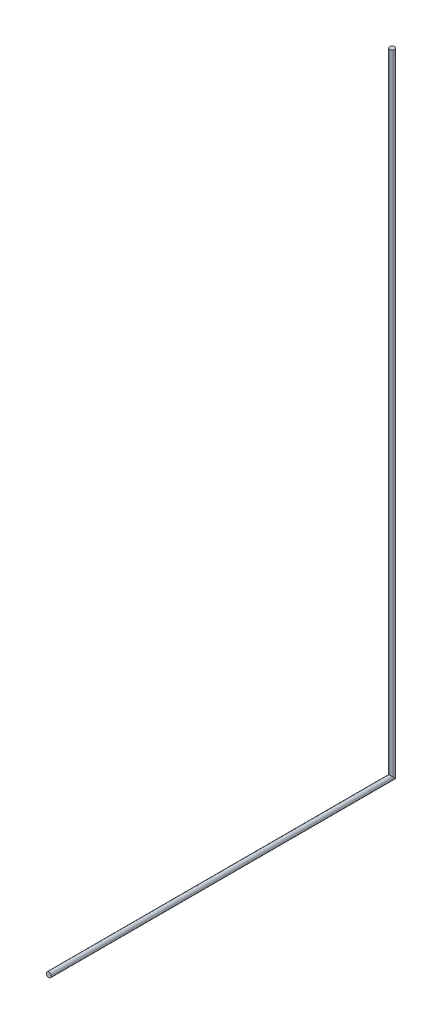
ISO-10303-21;
HEADER;
FILE_DESCRIPTION(('STEP AP214'),'2;1');
FILE_NAME('part.step','',(''),(''),'','','');
FILE_SCHEMA(('AUTOMOTIVE_DESIGN { 1 0 10303 214 1 1 1 1 }'));
ENDSEC;
DATA;
#1=APPLICATION_CONTEXT('core data for automotive mechanical design processes');
#2=APPLICATION_PROTOCOL_DEFINITION('international standard','automotive_design',2000,#1);
#3=PRODUCT_CONTEXT('',#1,'mechanical');
#4=PRODUCT('Part','Part','',(#3));
#5=PRODUCT_RELATED_PRODUCT_CATEGORY('part','',(#4));
#6=PRODUCT_DEFINITION_FORMATION('','',#4);
#7=PRODUCT_DEFINITION_CONTEXT('part definition',#1,'design');
#8=PRODUCT_DEFINITION('design','',#6,#7);
#9=PRODUCT_DEFINITION_SHAPE('','',#8);
#10=(LENGTH_UNIT() NAMED_UNIT(*) SI_UNIT(.MILLI.,.METRE.));
#11=(NAMED_UNIT(*) PLANE_ANGLE_UNIT() SI_UNIT($,.RADIAN.));
#12=(NAMED_UNIT(*) SI_UNIT($,.STERADIAN.) SOLID_ANGLE_UNIT());
#13=UNCERTAINTY_MEASURE_WITH_UNIT(LENGTH_MEASURE(1.E-05),#10,'distance_accuracy_value','');
#14=(GEOMETRIC_REPRESENTATION_CONTEXT(3) GLOBAL_UNCERTAINTY_ASSIGNED_CONTEXT((#13)) GLOBAL_UNIT_ASSIGNED_CONTEXT((#10,
#11,#12)) REPRESENTATION_CONTEXT('',''));
#15=CARTESIAN_POINT('',(0.,0.,0.));
#16=DIRECTION('',(0.,0.,1.));
#17=DIRECTION('',(1.,0.,0.));
#18=AXIS2_PLACEMENT_3D('',#15,#16,#17);
#19=CARTESIAN_POINT('',(0.,1015.,0.));
#20=DIRECTION('',(0.,-1.,0.));
#21=DIRECTION('',(0.,0.,-1.));
#22=AXIS2_PLACEMENT_3D('',#19,#20,#21);
#23=CYLINDRICAL_SURFACE('',#22,4.);
#24=CARTESIAN_POINT('',(0.,1015.,0.));
#25=DIRECTION('',(0.,1.,0.));
#26=DIRECTION('',(0.,0.,1.));
#27=AXIS2_PLACEMENT_3D('',#24,#25,#26);
#28=CIRCLE('',#27,4.);
#29=CARTESIAN_POINT('',(0.,1015.,4.));
#30=VERTEX_POINT('',#29);
#31=EDGE_CURVE('E57',#30,#30,#28,.T.);
#32=ORIENTED_EDGE('',*,*,#31,.F.);
#33=EDGE_LOOP('',(#32));
#34=FACE_BOUND('',#33,.T.);
#35=CARTESIAN_POINT('',(0.,0.,0.));
#36=DIRECTION('',(0.,-0.707106781186547,0.707106781186547));
#37=DIRECTION('',(0.,-0.707106781186547,-0.707106781186547));
#38=AXIS2_PLACEMENT_3D('',#35,#36,#37);
#39=ELLIPSE('',#38,5.65685424949238,4.);
#40=CARTESIAN_POINT('',(1.22559864599022,-3.80761184457488,-3.80761184457488));
#41=VERTEX_POINT('',#40);
#42=CARTESIAN_POINT('',(-1.22559864599022,-3.80761184457488,-3.80761184457488));
#43=VERTEX_POINT('',#42);
#44=EDGE_CURVE('E53',#41,#43,#39,.T.);
#45=ORIENTED_EDGE('',*,*,#44,.F.);
#46=CARTESIAN_POINT('',(1.22559864599022,-3.80761184457488,-3.80761184457488));
#47=CARTESIAN_POINT('',(1.14961819614779,-3.78314526169094,-3.83208358698599));
#48=CARTESIAN_POINT('',(1.0722205724013,-3.76094782874469,-3.85447165487816));
#49=CARTESIAN_POINT('',(0.9150235890672,-3.72122051367196,-3.89477737938818));
#50=CARTESIAN_POINT('',(0.83522218105041,-3.70369474545752,-3.91269109498081));
#51=CARTESIAN_POINT('',(0.674412434066959,-3.67360082609168,-3.94358051499167));
#52=CARTESIAN_POINT('',(0.593418286892976,-3.66099521981096,-3.95659349882085));
#53=CARTESIAN_POINT('',(0.430233645583273,-3.64065585095897,-3.97764475896942));
#54=CARTESIAN_POINT('',(0.348044108768466,-3.6329183882315,-3.98568681348809));
#55=CARTESIAN_POINT('',(0.221430486354409,-3.62482092938283,-3.9941112151552));
#56=CARTESIAN_POINT('',(0.177227967433131,-3.62270339284512,-3.99631648399588));
#57=CARTESIAN_POINT('',(0.08868924320615,-3.61987581969878,-3.99926279764117));
#58=CARTESIAN_POINT('',(0.0443529470032866,-3.61916723820318,-4.00000232868723));
#59=CARTESIAN_POINT('',(-0.166213391247529,-3.61917313533035,-3.99999127320668));
#60=CARTESIAN_POINT('',(-0.332660624310084,-3.62914646721265,-3.98956395859056));
#61=CARTESIAN_POINT('',(-0.66072562925482,-3.66878935573819,-3.94852043275604));
#62=CARTESIAN_POINT('',(-0.822339456046413,-3.69847456639303,-3.91788817609346));
#63=CARTESIAN_POINT('',(-1.02097621716827,-3.74785384783352,-3.86774949311949));
#64=CARTESIAN_POINT('',(-1.06247227559088,-3.75891631566767,-3.85655182121315));
#65=CARTESIAN_POINT('',(-1.1446359901228,-3.78231298252752,-3.83296527397649));
#66=CARTESIAN_POINT('',(-1.18530552146106,-3.79464379615436,-3.82057957533968));
#67=CARTESIAN_POINT('',(-1.22559864599022,-3.80761184457488,-3.80761184457488));
#68=B_SPLINE_CURVE_WITH_KNOTS('',3,(#46,#47,#48,#49,#50,#51,#52,#53,#54,#55,#56,#57,#58,#59,#60,
#61,#62,#63,#64,#65,#66,#67),.UNSPECIFIED.,.F.,.F.,(4,2,2,2,2,2,2,2,2,2,4),(0.,
0.250422477150816,0.501064755575985,0.749759943312609,0.99826587486621,1.13114546066869,
1.26416220812098,1.76264463557102,2.26152340255579,2.39464114560669,2.52741237039437),.UNSPECIFIED.);
#69=EDGE_CURVE('E11',#41,#43,#68,.T.);
#70=ORIENTED_EDGE('',*,*,#69,.T.);
#71=EDGE_LOOP('',(#45,#70));
#72=FACE_BOUND('',#71,.T.);
#73=ADVANCED_FACE('F35',(#34,#72),#23,.T.);
#74=CARTESIAN_POINT('',(0.,1015.,0.));
#75=DIRECTION('',(0.,1.,0.));
#76=DIRECTION('',(0.,0.,1.));
#77=AXIS2_PLACEMENT_3D('',#74,#75,#76);
#78=PLANE('',#77);
#79=ORIENTED_EDGE('',*,*,#31,.T.);
#80=EDGE_LOOP('',(#79));
#81=FACE_BOUND('',#80,.T.);
#82=ADVANCED_FACE('F73',(#81),#78,.T.);
#83=CARTESIAN_POINT('',(0.,0.,552.5));
#84=DIRECTION('',(0.,0.,-1.));
#85=DIRECTION('',(-1.,0.,0.));
#86=AXIS2_PLACEMENT_3D('',#83,#84,#85);
#87=CYLINDRICAL_SURFACE('',#86,4.);
#88=CARTESIAN_POINT('',(0.,0.,552.5));
#89=DIRECTION('',(0.,0.,1.));
#90=DIRECTION('',(1.,0.,0.));
#91=AXIS2_PLACEMENT_3D('',#88,#89,#90);
#92=CIRCLE('',#91,4.);
#93=CARTESIAN_POINT('',(4.,0.,552.5));
#94=VERTEX_POINT('',#93);
#95=EDGE_CURVE('E58',#94,#94,#92,.T.);
#96=ORIENTED_EDGE('',*,*,#95,.F.);
#97=EDGE_LOOP('',(#96));
#98=FACE_BOUND('',#97,.T.);
#99=ORIENTED_EDGE('',*,*,#44,.T.);
#100=CARTESIAN_POINT('',(-1.22559864599022,-3.80761184457488,-3.80761184457488));
#101=CARTESIAN_POINT('',(-1.14961819614779,-3.83208358698599,-3.78314526169094));
#102=CARTESIAN_POINT('',(-1.0722205724013,-3.85447165487816,-3.76094782874469));
#103=CARTESIAN_POINT('',(-0.9150235890672,-3.89477737938818,-3.72122051367196));
#104=CARTESIAN_POINT('',(-0.83522218105041,-3.91269109498081,-3.70369474545752));
#105=CARTESIAN_POINT('',(-0.674412434066959,-3.94358051499167,-3.67360082609169));
#106=CARTESIAN_POINT('',(-0.593418286892976,-3.95659349882085,-3.66099521981096));
#107=CARTESIAN_POINT('',(-0.430233645583273,-3.97764475896942,-3.64065585095897));
#108=CARTESIAN_POINT('',(-0.348044108768466,-3.98568681348809,-3.6329183882315));
#109=CARTESIAN_POINT('',(-0.22143048635441,-3.9941112151552,-3.62482092938283));
#110=CARTESIAN_POINT('',(-0.177227967433131,-3.99631648399588,-3.62270339284512));
#111=CARTESIAN_POINT('',(-0.0886892432061505,-3.99926279764117,-3.61987581969879));
#112=CARTESIAN_POINT('',(-0.0443529470032869,-4.00000232868723,-3.61916723820318));
#113=CARTESIAN_POINT('',(0.166213391247529,-3.99999127320668,-3.61917313533035));
#114=CARTESIAN_POINT('',(0.332660624310084,-3.98956395859056,-3.62914646721265));
#115=CARTESIAN_POINT('',(0.66072562925482,-3.94852043275604,-3.66878935573819));
#116=CARTESIAN_POINT('',(0.822339456046413,-3.91788817609346,-3.69847456639303));
#117=CARTESIAN_POINT('',(1.02097621716827,-3.86774949311949,-3.74785384783352));
#118=CARTESIAN_POINT('',(1.06247227559088,-3.85655182121315,-3.75891631566768));
#119=CARTESIAN_POINT('',(1.1446359901228,-3.83296527397649,-3.78231298252752));
#120=CARTESIAN_POINT('',(1.18530552146106,-3.82057957533968,-3.79464379615436));
#121=CARTESIAN_POINT('',(1.22559864599022,-3.80761184457488,-3.80761184457488));
#122=B_SPLINE_CURVE_WITH_KNOTS('',3,(#100,#101,#102,#103,#104,#105,#106,#107,#108,#109,#110,
#111,#112,#113,#114,#115,#116,#117,#118,#119,#120,#121),.UNSPECIFIED.,.F.,.F.,(4,2,2,2,2,2,2,2,
2,2,4),(0.,0.250422477150815,0.501064755575985,0.749759943312609,0.998265874866209,
1.13114546066869,1.26416220812098,1.76264463557102,2.26152340255579,2.39464114560669,
2.52741237039437),.UNSPECIFIED.);
#123=EDGE_CURVE('E47',#43,#41,#122,.T.);
#124=ORIENTED_EDGE('',*,*,#123,.T.);
#125=EDGE_LOOP('',(#99,#124));
#126=FACE_BOUND('',#125,.T.);
#127=ADVANCED_FACE('F61',(#98,#126),#87,.T.);
#128=CARTESIAN_POINT('',(0.,0.,552.5));
#129=DIRECTION('',(0.,0.,1.));
#130=DIRECTION('',(1.,0.,0.));
#131=AXIS2_PLACEMENT_3D('',#128,#129,#130);
#132=PLANE('',#131);
#133=ORIENTED_EDGE('',*,*,#95,.T.);
#134=EDGE_LOOP('',(#133));
#135=FACE_BOUND('',#134,.T.);
#136=ADVANCED_FACE('F72',(#135),#132,.T.);
#137=CARTESIAN_POINT('',(0.,-13.,-13.));
#138=DIRECTION('',(-1.,0.,0.));
#139=DIRECTION('',(0.,0.,1.));
#140=AXIS2_PLACEMENT_3D('',#137,#138,#139);
#141=CYLINDRICAL_SURFACE('',#140,13.);
#142=ORIENTED_EDGE('',*,*,#123,.F.);
#143=ORIENTED_EDGE('',*,*,#69,.F.);
#144=EDGE_LOOP('',(#142,#143));
#145=FACE_BOUND('',#144,.T.);
#146=ADVANCED_FACE('F37',(#145),#141,.F.);
#147=CLOSED_SHELL('',(#73,#82,#127,#136,#146));
#148=MANIFOLD_SOLID_BREP('B2',#147);
#149=ADVANCED_BREP_SHAPE_REPRESENTATION('',(#18,#148),#14);
#150=SHAPE_DEFINITION_REPRESENTATION(#9,#149);
ENDSEC;
END-ISO-10303-21;
